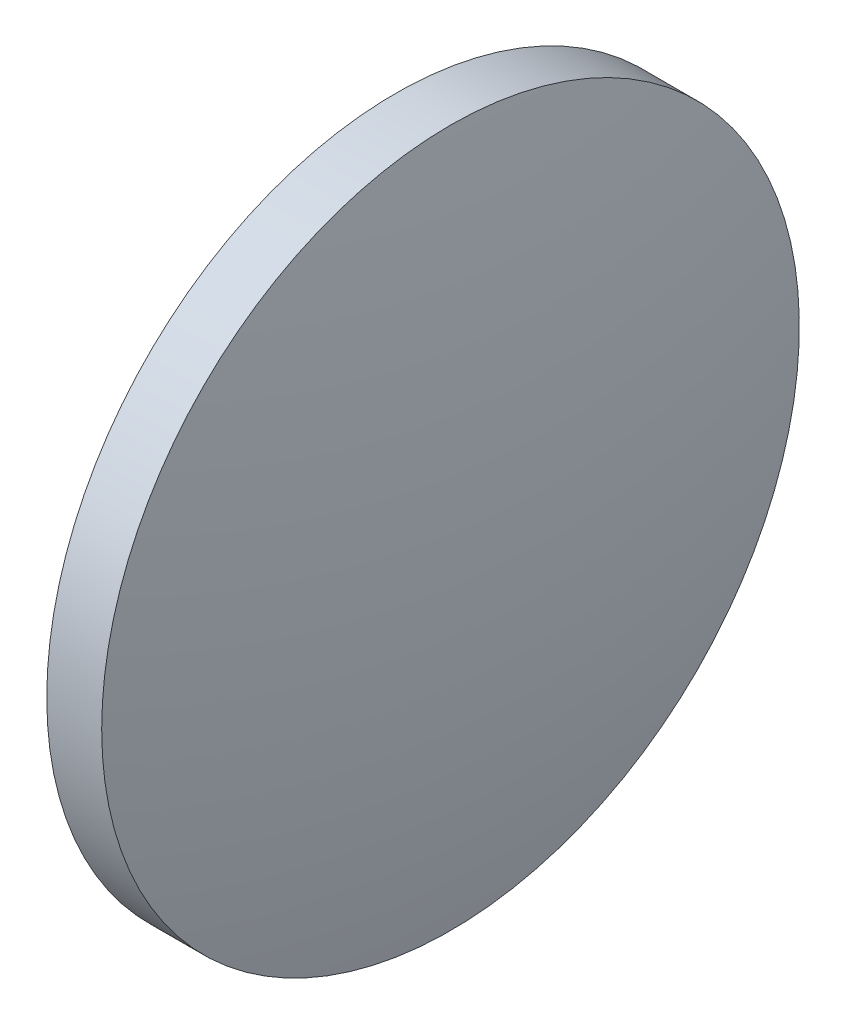
ISO-10303-21;
HEADER;
FILE_DESCRIPTION(('STEP AP214'),'2;1');
FILE_NAME('part.step','',(''),(''),'','','');
FILE_SCHEMA(('AUTOMOTIVE_DESIGN { 1 0 10303 214 1 1 1 1 }'));
ENDSEC;
DATA;
#1=APPLICATION_CONTEXT('core data for automotive mechanical design processes');
#2=APPLICATION_PROTOCOL_DEFINITION('international standard','automotive_design',2000,#1);
#3=PRODUCT_CONTEXT('',#1,'mechanical');
#4=PRODUCT('Part','Part','',(#3));
#5=PRODUCT_RELATED_PRODUCT_CATEGORY('part','',(#4));
#6=PRODUCT_DEFINITION_FORMATION('','',#4);
#7=PRODUCT_DEFINITION_CONTEXT('part definition',#1,'design');
#8=PRODUCT_DEFINITION('design','',#6,#7);
#9=PRODUCT_DEFINITION_SHAPE('','',#8);
#10=(LENGTH_UNIT() NAMED_UNIT(*) SI_UNIT(.MILLI.,.METRE.));
#11=(NAMED_UNIT(*) PLANE_ANGLE_UNIT() SI_UNIT($,.RADIAN.));
#12=(NAMED_UNIT(*) SI_UNIT($,.STERADIAN.) SOLID_ANGLE_UNIT());
#13=UNCERTAINTY_MEASURE_WITH_UNIT(LENGTH_MEASURE(1.E-05),#10,'distance_accuracy_value','');
#14=(GEOMETRIC_REPRESENTATION_CONTEXT(3) GLOBAL_UNCERTAINTY_ASSIGNED_CONTEXT((#13)) GLOBAL_UNIT_ASSIGNED_CONTEXT((#10,
#11,#12)) REPRESENTATION_CONTEXT('',''));
#15=CARTESIAN_POINT('',(0.,0.,0.));
#16=DIRECTION('',(0.,0.,1.));
#17=DIRECTION('',(1.,0.,0.));
#18=AXIS2_PLACEMENT_3D('',#15,#16,#17);
#19=CARTESIAN_POINT('',(390.456994320192,96.7242795128648,0.));
#20=DIRECTION('',(-1.,0.,0.));
#21=DIRECTION('',(0.,1.,0.));
#22=AXIS2_PLACEMENT_3D('',#19,#20,#21);
#23=SPHERICAL_SURFACE('',#22,62.6846153846155);
#24=CARTESIAN_POINT('',(451.841609704808,96.7242795128649,0.));
#25=DIRECTION('',(-1.,0.,0.));
#26=DIRECTION('',(0.,0.,1.));
#27=AXIS2_PLACEMENT_3D('',#24,#25,#26);
#28=CIRCLE('',#27,12.7);
#29=CARTESIAN_POINT('',(451.841609704808,96.7242795128649,12.7));
#30=VERTEX_POINT('',#29);
#31=EDGE_CURVE('E10',#30,#30,#28,.T.);
#32=ORIENTED_EDGE('',*,*,#31,.F.);
#33=EDGE_LOOP('',(#32));
#34=FACE_BOUND('',#33,.T.);
#35=ADVANCED_FACE('F35',(#34),#23,.T.);
#36=CARTESIAN_POINT('',(444.103391669131,96.7242795128649,0.));
#37=DIRECTION('',(-1.,0.,0.));
#38=DIRECTION('',(0.,0.,1.));
#39=AXIS2_PLACEMENT_3D('',#36,#37,#38);
#40=CYLINDRICAL_SURFACE('',#39,12.7);
#41=CARTESIAN_POINT('',(449.841609704808,96.7242795128649,0.));
#42=DIRECTION('',(-1.,0.,0.));
#43=DIRECTION('',(0.,0.,1.));
#44=AXIS2_PLACEMENT_3D('',#41,#42,#43);
#45=CIRCLE('',#44,12.7);
#46=CARTESIAN_POINT('',(449.841609704808,96.7242795128649,12.7));
#47=VERTEX_POINT('',#46);
#48=EDGE_CURVE('E41',#47,#47,#45,.T.);
#49=ORIENTED_EDGE('',*,*,#48,.F.);
#50=EDGE_LOOP('',(#49));
#51=FACE_BOUND('',#50,.T.);
#52=ORIENTED_EDGE('',*,*,#31,.T.);
#53=EDGE_LOOP('',(#52));
#54=FACE_BOUND('',#53,.T.);
#55=ADVANCED_FACE('F49',(#51,#54),#40,.T.);
#56=CARTESIAN_POINT('',(449.841609704808,96.7242795128649,0.));
#57=DIRECTION('',(1.,0.,0.));
#58=DIRECTION('',(0.,0.,-1.));
#59=AXIS2_PLACEMENT_3D('',#56,#57,#58);
#60=PLANE('',#59);
#61=ORIENTED_EDGE('',*,*,#48,.T.);
#62=EDGE_LOOP('',(#61));
#63=FACE_BOUND('',#62,.T.);
#64=ADVANCED_FACE('F47',(#63),#60,.F.);
#65=CLOSED_SHELL('',(#35,#55,#64));
#66=MANIFOLD_SOLID_BREP('B2',#65);
#67=ADVANCED_BREP_SHAPE_REPRESENTATION('',(#18,#66),#14);
#68=SHAPE_DEFINITION_REPRESENTATION(#9,#67);
ENDSEC;
END-ISO-10303-21;
